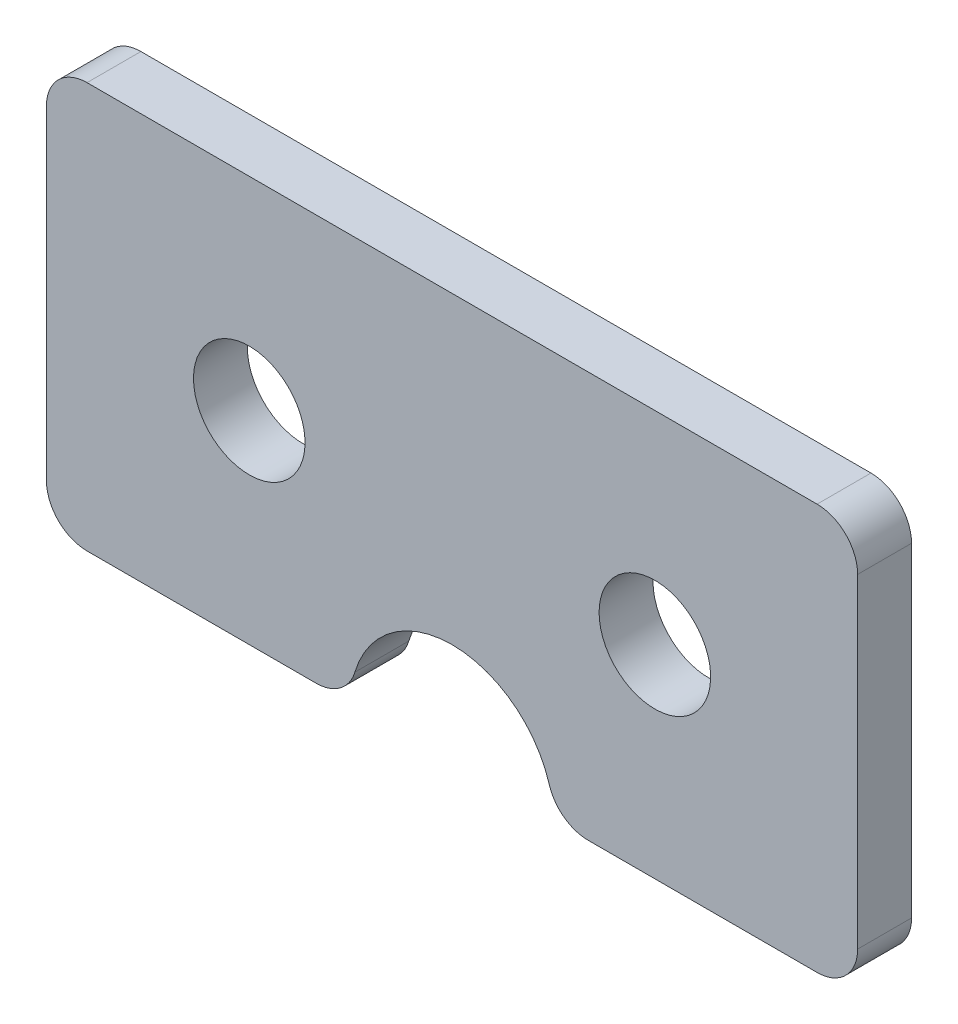
ISO-10303-21;
HEADER;
FILE_DESCRIPTION(('STEP AP214'),'2;1');
FILE_NAME('part.step','',(''),(''),'','','');
FILE_SCHEMA(('AUTOMOTIVE_DESIGN { 1 0 10303 214 1 1 1 1 }'));
ENDSEC;
DATA;
#1=APPLICATION_CONTEXT('core data for automotive mechanical design processes');
#2=APPLICATION_PROTOCOL_DEFINITION('international standard','automotive_design',2000,#1);
#3=PRODUCT_CONTEXT('',#1,'mechanical');
#4=PRODUCT('Part','Part','',(#3));
#5=PRODUCT_RELATED_PRODUCT_CATEGORY('part','',(#4));
#6=PRODUCT_DEFINITION_FORMATION('','',#4);
#7=PRODUCT_DEFINITION_CONTEXT('part definition',#1,'design');
#8=PRODUCT_DEFINITION('design','',#6,#7);
#9=PRODUCT_DEFINITION_SHAPE('','',#8);
#10=(LENGTH_UNIT() NAMED_UNIT(*) SI_UNIT(.MILLI.,.METRE.));
#11=(NAMED_UNIT(*) PLANE_ANGLE_UNIT() SI_UNIT($,.RADIAN.));
#12=(NAMED_UNIT(*) SI_UNIT($,.STERADIAN.) SOLID_ANGLE_UNIT());
#13=UNCERTAINTY_MEASURE_WITH_UNIT(LENGTH_MEASURE(1.E-05),#10,'distance_accuracy_value','');
#14=(GEOMETRIC_REPRESENTATION_CONTEXT(3) GLOBAL_UNCERTAINTY_ASSIGNED_CONTEXT((#13)) GLOBAL_UNIT_ASSIGNED_CONTEXT((#10,
#11,#12)) REPRESENTATION_CONTEXT('',''));
#15=CARTESIAN_POINT('',(0.,0.,0.));
#16=DIRECTION('',(0.,0.,1.));
#17=DIRECTION('',(1.,0.,0.));
#18=AXIS2_PLACEMENT_3D('',#15,#16,#17);
#19=CARTESIAN_POINT('',(0.,0.161688531272491,0.));
#20=DIRECTION('',(0.,0.,1.));
#21=DIRECTION('',(1.,0.,0.));
#22=AXIS2_PLACEMENT_3D('',#19,#20,#21);
#23=PLANE('',#22);
#24=DIRECTION('',(-1.,0.,0.));
#25=VECTOR('',#24,1.);
#26=CARTESIAN_POINT('',(20.,10.,0.));
#27=LINE('',#26,#25);
#28=CARTESIAN_POINT('',(18.,10.,0.));
#29=VERTEX_POINT('',#28);
#30=CARTESIAN_POINT('',(-18.,10.,0.));
#31=VERTEX_POINT('',#30);
#32=EDGE_CURVE('E107',#29,#31,#27,.T.);
#33=ORIENTED_EDGE('',*,*,#32,.F.);
#34=CARTESIAN_POINT('',(18.,8.,0.));
#35=DIRECTION('',(0.,0.,1.));
#36=DIRECTION('',(1.,0.,0.));
#37=AXIS2_PLACEMENT_3D('',#34,#35,#36);
#38=CIRCLE('',#37,2.);
#39=CARTESIAN_POINT('',(20.,8.,0.));
#40=VERTEX_POINT('',#39);
#41=EDGE_CURVE('E120',#40,#29,#38,.T.);
#42=ORIENTED_EDGE('',*,*,#41,.F.);
#43=DIRECTION('',(0.,1.,0.));
#44=VECTOR('',#43,1.);
#45=CARTESIAN_POINT('',(20.,-10.,0.));
#46=LINE('',#45,#44);
#47=CARTESIAN_POINT('',(20.,-8.,0.));
#48=VERTEX_POINT('',#47);
#49=EDGE_CURVE('E132',#48,#40,#46,.T.);
#50=ORIENTED_EDGE('',*,*,#49,.F.);
#51=CARTESIAN_POINT('',(18.,-8.,0.));
#52=DIRECTION('',(0.,0.,1.));
#53=DIRECTION('',(1.,0.,0.));
#54=AXIS2_PLACEMENT_3D('',#51,#52,#53);
#55=CIRCLE('',#54,2.);
#56=CARTESIAN_POINT('',(18.,-10.,0.));
#57=VERTEX_POINT('',#56);
#58=EDGE_CURVE('E175',#57,#48,#55,.T.);
#59=ORIENTED_EDGE('',*,*,#58,.F.);
#60=DIRECTION('',(1.,0.,0.));
#61=VECTOR('',#60,1.);
#62=CARTESIAN_POINT('',(5.,-10.,0.));
#63=LINE('',#62,#61);
#64=CARTESIAN_POINT('',(6.70820393249937,-10.,0.));
#65=VERTEX_POINT('',#64);
#66=EDGE_CURVE('E136',#65,#57,#63,.T.);
#67=ORIENTED_EDGE('',*,*,#66,.F.);
#68=CARTESIAN_POINT('',(6.70820393249937,-8.,0.));
#69=DIRECTION('',(0.,0.,1.));
#70=DIRECTION('',(1.,0.,0.));
#71=AXIS2_PLACEMENT_3D('',#68,#69,#70);
#72=CIRCLE('',#71,2.);
#73=CARTESIAN_POINT('',(4.79157423749955,-8.57142857142857,0.));
#74=VERTEX_POINT('',#73);
#75=EDGE_CURVE('E177',#74,#65,#72,.T.);
#76=ORIENTED_EDGE('',*,*,#75,.F.);
#77=CARTESIAN_POINT('',(0.,-10.,0.));
#78=DIRECTION('',(0.,0.,1.));
#79=DIRECTION('',(1.,0.,0.));
#80=AXIS2_PLACEMENT_3D('',#77,#78,#79);
#81=CIRCLE('',#80,5.);
#82=CARTESIAN_POINT('',(-4.79157423749955,-8.57142857142857,0.));
#83=VERTEX_POINT('',#82);
#84=EDGE_CURVE('E180',#74,#83,#81,.T.);
#85=ORIENTED_EDGE('',*,*,#84,.T.);
#86=CARTESIAN_POINT('',(-6.70820393249937,-8.,0.));
#87=DIRECTION('',(0.,0.,1.));
#88=DIRECTION('',(1.,0.,0.));
#89=AXIS2_PLACEMENT_3D('',#86,#87,#88);
#90=CIRCLE('',#89,2.);
#91=CARTESIAN_POINT('',(-6.70820393249937,-9.99999999999999,0.));
#92=VERTEX_POINT('',#91);
#93=EDGE_CURVE('E183',#92,#83,#90,.T.);
#94=ORIENTED_EDGE('',*,*,#93,.F.);
#95=DIRECTION('',(1.,0.,0.));
#96=VECTOR('',#95,1.);
#97=CARTESIAN_POINT('',(-20.,-9.99999999999999,0.));
#98=LINE('',#97,#96);
#99=CARTESIAN_POINT('',(-18.,-9.99999999999999,0.));
#100=VERTEX_POINT('',#99);
#101=EDGE_CURVE('E140',#100,#92,#98,.T.);
#102=ORIENTED_EDGE('',*,*,#101,.F.);
#103=CARTESIAN_POINT('',(-18.,-7.99999999999999,0.));
#104=DIRECTION('',(0.,0.,1.));
#105=DIRECTION('',(1.,0.,0.));
#106=AXIS2_PLACEMENT_3D('',#103,#104,#105);
#107=CIRCLE('',#106,2.);
#108=CARTESIAN_POINT('',(-20.,-7.99999999999999,0.));
#109=VERTEX_POINT('',#108);
#110=EDGE_CURVE('E185',#109,#100,#107,.T.);
#111=ORIENTED_EDGE('',*,*,#110,.F.);
#112=DIRECTION('',(0.,-1.,0.));
#113=VECTOR('',#112,1.);
#114=CARTESIAN_POINT('',(-20.,10.,0.));
#115=LINE('',#114,#113);
#116=CARTESIAN_POINT('',(-20.,8.,0.));
#117=VERTEX_POINT('',#116);
#118=EDGE_CURVE('E109',#117,#109,#115,.T.);
#119=ORIENTED_EDGE('',*,*,#118,.F.);
#120=CARTESIAN_POINT('',(-18.,8.,0.));
#121=DIRECTION('',(0.,0.,1.));
#122=DIRECTION('',(1.,0.,0.));
#123=AXIS2_PLACEMENT_3D('',#120,#121,#122);
#124=CIRCLE('',#123,2.);
#125=EDGE_CURVE('E19',#31,#117,#124,.T.);
#126=ORIENTED_EDGE('',*,*,#125,.F.);
#127=EDGE_LOOP('',(#33,#42,#50,#59,#67,#76,#85,#94,#102,#111,#119,#126));
#128=FACE_BOUND('',#127,.T.);
#129=CARTESIAN_POINT('',(10.,0.,0.));
#130=DIRECTION('',(0.,0.,-1.));
#131=DIRECTION('',(-1.,0.,0.));
#132=AXIS2_PLACEMENT_3D('',#129,#130,#131);
#133=CIRCLE('',#132,2.75);
#134=CARTESIAN_POINT('',(7.25,0.,0.));
#135=VERTEX_POINT('',#134);
#136=EDGE_CURVE('E126',#135,#135,#133,.F.);
#137=ORIENTED_EDGE('',*,*,#136,.T.);
#138=EDGE_LOOP('',(#137));
#139=FACE_BOUND('',#138,.T.);
#140=CARTESIAN_POINT('',(-10.,0.,0.));
#141=DIRECTION('',(0.,0.,-1.));
#142=DIRECTION('',(-1.,0.,0.));
#143=AXIS2_PLACEMENT_3D('',#140,#141,#142);
#144=CIRCLE('',#143,2.75);
#145=CARTESIAN_POINT('',(-12.75,0.,0.));
#146=VERTEX_POINT('',#145);
#147=EDGE_CURVE('E123',#146,#146,#144,.F.);
#148=ORIENTED_EDGE('',*,*,#147,.T.);
#149=EDGE_LOOP('',(#148));
#150=FACE_BOUND('',#149,.T.);
#151=ADVANCED_FACE('F16',(#128,#139,#150),#23,.F.);
#152=CARTESIAN_POINT('',(-18.,8.,0.));
#153=DIRECTION('',(0.,0.,1.));
#154=DIRECTION('',(1.,0.,0.));
#155=AXIS2_PLACEMENT_3D('',#152,#153,#154);
#156=CYLINDRICAL_SURFACE('',#155,2.);
#157=ORIENTED_EDGE('',*,*,#125,.T.);
#158=DIRECTION('',(0.,0.,1.));
#159=VECTOR('',#158,1.);
#160=CARTESIAN_POINT('',(-20.,8.,0.));
#161=LINE('',#160,#159);
#162=CARTESIAN_POINT('',(-20.,8.,2.65684));
#163=VERTEX_POINT('',#162);
#164=EDGE_CURVE('E112',#163,#117,#161,.F.);
#165=ORIENTED_EDGE('',*,*,#164,.F.);
#166=CARTESIAN_POINT('',(-18.,8.,2.65684));
#167=DIRECTION('',(0.,0.,1.));
#168=DIRECTION('',(1.,0.,0.));
#169=AXIS2_PLACEMENT_3D('',#166,#167,#168);
#170=CIRCLE('',#169,2.);
#171=CARTESIAN_POINT('',(-18.,10.,2.65684));
#172=VERTEX_POINT('',#171);
#173=EDGE_CURVE('E117',#172,#163,#170,.T.);
#174=ORIENTED_EDGE('',*,*,#173,.F.);
#175=DIRECTION('',(0.,0.,1.));
#176=VECTOR('',#175,1.);
#177=CARTESIAN_POINT('',(-18.,10.,0.));
#178=LINE('',#177,#176);
#179=EDGE_CURVE('E114',#31,#172,#178,.T.);
#180=ORIENTED_EDGE('',*,*,#179,.F.);
#181=EDGE_LOOP('',(#157,#165,#174,#180));
#182=FACE_BOUND('',#181,.T.);
#183=ADVANCED_FACE('F115',(#182),#156,.T.);
#184=CARTESIAN_POINT('',(-20.,10.,0.));
#185=DIRECTION('',(-1.,0.,0.));
#186=DIRECTION('',(0.,-1.,0.));
#187=AXIS2_PLACEMENT_3D('',#184,#185,#186);
#188=PLANE('',#187);
#189=DIRECTION('',(0.,0.,1.));
#190=VECTOR('',#189,1.);
#191=CARTESIAN_POINT('',(-20.,-7.99999999999999,0.));
#192=LINE('',#191,#190);
#193=CARTESIAN_POINT('',(-20.,-7.99999999999999,2.65684));
#194=VERTEX_POINT('',#193);
#195=EDGE_CURVE('E144',#194,#109,#192,.F.);
#196=ORIENTED_EDGE('',*,*,#195,.F.);
#197=DIRECTION('',(0.,1.,0.));
#198=VECTOR('',#197,1.);
#199=CARTESIAN_POINT('',(-20.,0.161688531272491,2.65684));
#200=LINE('',#199,#198);
#201=EDGE_CURVE('E170',#163,#194,#200,.F.);
#202=ORIENTED_EDGE('',*,*,#201,.F.);
#203=ORIENTED_EDGE('',*,*,#164,.T.);
#204=ORIENTED_EDGE('',*,*,#118,.T.);
#205=EDGE_LOOP('',(#196,#202,#203,#204));
#206=FACE_BOUND('',#205,.T.);
#207=ADVANCED_FACE('F247',(#206),#188,.T.);
#208=CARTESIAN_POINT('',(-18.,-7.99999999999999,0.));
#209=DIRECTION('',(0.,0.,1.));
#210=DIRECTION('',(1.,0.,0.));
#211=AXIS2_PLACEMENT_3D('',#208,#209,#210);
#212=CYLINDRICAL_SURFACE('',#211,2.);
#213=ORIENTED_EDGE('',*,*,#110,.T.);
#214=DIRECTION('',(0.,0.,1.));
#215=VECTOR('',#214,1.);
#216=CARTESIAN_POINT('',(-18.,-9.99999999999999,0.));
#217=LINE('',#216,#215);
#218=CARTESIAN_POINT('',(-18.,-9.99999999999999,2.65684));
#219=VERTEX_POINT('',#218);
#220=EDGE_CURVE('E143',#219,#100,#217,.F.);
#221=ORIENTED_EDGE('',*,*,#220,.F.);
#222=CARTESIAN_POINT('',(-18.,-7.99999999999999,2.65684));
#223=DIRECTION('',(0.,0.,1.));
#224=DIRECTION('',(1.,0.,0.));
#225=AXIS2_PLACEMENT_3D('',#222,#223,#224);
#226=CIRCLE('',#225,2.);
#227=EDGE_CURVE('E167',#194,#219,#226,.T.);
#228=ORIENTED_EDGE('',*,*,#227,.F.);
#229=ORIENTED_EDGE('',*,*,#195,.T.);
#230=EDGE_LOOP('',(#213,#221,#228,#229));
#231=FACE_BOUND('',#230,.T.);
#232=ADVANCED_FACE('F244',(#231),#212,.T.);
#233=CARTESIAN_POINT('',(-20.,-9.99999999999999,0.));
#234=DIRECTION('',(0.,-1.,0.));
#235=DIRECTION('',(1.,0.,0.));
#236=AXIS2_PLACEMENT_3D('',#233,#234,#235);
#237=PLANE('',#236);
#238=ORIENTED_EDGE('',*,*,#220,.T.);
#239=ORIENTED_EDGE('',*,*,#101,.T.);
#240=DIRECTION('',(0.,0.,1.));
#241=VECTOR('',#240,1.);
#242=CARTESIAN_POINT('',(-6.70820393249937,-10.,0.));
#243=LINE('',#242,#241);
#244=CARTESIAN_POINT('',(-6.70820393249937,-9.99999999999999,2.65684));
#245=VERTEX_POINT('',#244);
#246=EDGE_CURVE('E142',#245,#92,#243,.F.);
#247=ORIENTED_EDGE('',*,*,#246,.F.);
#248=DIRECTION('',(1.,0.,0.));
#249=VECTOR('',#248,1.);
#250=CARTESIAN_POINT('',(0.,-9.99999999999999,2.65684));
#251=LINE('',#250,#249);
#252=EDGE_CURVE('E166',#219,#245,#251,.T.);
#253=ORIENTED_EDGE('',*,*,#252,.F.);
#254=EDGE_LOOP('',(#238,#239,#247,#253));
#255=FACE_BOUND('',#254,.T.);
#256=ADVANCED_FACE('F243',(#255),#237,.T.);
#257=CARTESIAN_POINT('',(-6.70820393249937,-8.,0.));
#258=DIRECTION('',(0.,0.,1.));
#259=DIRECTION('',(1.,0.,0.));
#260=AXIS2_PLACEMENT_3D('',#257,#258,#259);
#261=CYLINDRICAL_SURFACE('',#260,2.);
#262=ORIENTED_EDGE('',*,*,#93,.T.);
#263=DIRECTION('',(0.,0.,1.));
#264=VECTOR('',#263,1.);
#265=CARTESIAN_POINT('',(-4.79157423749955,-8.57142857142857,0.));
#266=LINE('',#265,#264);
#267=CARTESIAN_POINT('',(-4.79157423749955,-8.57142857142857,2.65684));
#268=VERTEX_POINT('',#267);
#269=EDGE_CURVE('E182',#83,#268,#266,.T.);
#270=ORIENTED_EDGE('',*,*,#269,.T.);
#271=CARTESIAN_POINT('',(-6.70820393249937,-8.,2.65684));
#272=DIRECTION('',(0.,0.,1.));
#273=DIRECTION('',(1.,0.,0.));
#274=AXIS2_PLACEMENT_3D('',#271,#272,#273);
#275=CIRCLE('',#274,2.);
#276=EDGE_CURVE('E163',#245,#268,#275,.T.);
#277=ORIENTED_EDGE('',*,*,#276,.F.);
#278=ORIENTED_EDGE('',*,*,#246,.T.);
#279=EDGE_LOOP('',(#262,#270,#277,#278));
#280=FACE_BOUND('',#279,.T.);
#281=ADVANCED_FACE('F237',(#280),#261,.T.);
#282=CARTESIAN_POINT('',(0.,-10.,0.));
#283=DIRECTION('',(0.,0.,1.));
#284=DIRECTION('',(1.,0.,0.));
#285=AXIS2_PLACEMENT_3D('',#282,#283,#284);
#286=CYLINDRICAL_SURFACE('',#285,5.);
#287=CARTESIAN_POINT('',(0.,-10.,2.65684));
#288=DIRECTION('',(0.,0.,1.));
#289=DIRECTION('',(1.,0.,0.));
#290=AXIS2_PLACEMENT_3D('',#287,#288,#289);
#291=CIRCLE('',#290,5.);
#292=CARTESIAN_POINT('',(4.79157423749955,-8.57142857142857,2.65684));
#293=VERTEX_POINT('',#292);
#294=EDGE_CURVE('E160',#268,#293,#291,.F.);
#295=ORIENTED_EDGE('',*,*,#294,.F.);
#296=ORIENTED_EDGE('',*,*,#269,.F.);
#297=ORIENTED_EDGE('',*,*,#84,.F.);
#298=DIRECTION('',(0.,0.,1.));
#299=VECTOR('',#298,1.);
#300=CARTESIAN_POINT('',(4.79157423749955,-8.57142857142857,0.));
#301=LINE('',#300,#299);
#302=EDGE_CURVE('E179',#293,#74,#301,.F.);
#303=ORIENTED_EDGE('',*,*,#302,.F.);
#304=EDGE_LOOP('',(#295,#296,#297,#303));
#305=FACE_BOUND('',#304,.T.);
#306=ADVANCED_FACE('F240',(#305),#286,.F.);
#307=CARTESIAN_POINT('',(6.70820393249937,-8.,0.));
#308=DIRECTION('',(0.,0.,1.));
#309=DIRECTION('',(1.,0.,0.));
#310=AXIS2_PLACEMENT_3D('',#307,#308,#309);
#311=CYLINDRICAL_SURFACE('',#310,2.);
#312=ORIENTED_EDGE('',*,*,#75,.T.);
#313=DIRECTION('',(0.,0.,1.));
#314=VECTOR('',#313,1.);
#315=CARTESIAN_POINT('',(6.70820393249937,-10.,0.));
#316=LINE('',#315,#314);
#317=CARTESIAN_POINT('',(6.70820393249937,-10.,2.65684));
#318=VERTEX_POINT('',#317);
#319=EDGE_CURVE('E139',#318,#65,#316,.F.);
#320=ORIENTED_EDGE('',*,*,#319,.F.);
#321=CARTESIAN_POINT('',(6.70820393249937,-8.,2.65684));
#322=DIRECTION('',(0.,0.,1.));
#323=DIRECTION('',(1.,0.,0.));
#324=AXIS2_PLACEMENT_3D('',#321,#322,#323);
#325=CIRCLE('',#324,2.);
#326=EDGE_CURVE('E157',#293,#318,#325,.T.);
#327=ORIENTED_EDGE('',*,*,#326,.F.);
#328=ORIENTED_EDGE('',*,*,#302,.T.);
#329=EDGE_LOOP('',(#312,#320,#327,#328));
#330=FACE_BOUND('',#329,.T.);
#331=ADVANCED_FACE('F232',(#330),#311,.T.);
#332=CARTESIAN_POINT('',(5.,-10.,0.));
#333=DIRECTION('',(0.,-1.,0.));
#334=DIRECTION('',(1.,0.,0.));
#335=AXIS2_PLACEMENT_3D('',#332,#333,#334);
#336=PLANE('',#335);
#337=DIRECTION('',(0.,0.,1.));
#338=VECTOR('',#337,1.);
#339=CARTESIAN_POINT('',(18.,-10.,0.));
#340=LINE('',#339,#338);
#341=CARTESIAN_POINT('',(18.,-10.,2.65684));
#342=VERTEX_POINT('',#341);
#343=EDGE_CURVE('E138',#342,#57,#340,.F.);
#344=ORIENTED_EDGE('',*,*,#343,.F.);
#345=DIRECTION('',(1.,0.,0.));
#346=VECTOR('',#345,1.);
#347=CARTESIAN_POINT('',(0.,-10.,2.65684));
#348=LINE('',#347,#346);
#349=EDGE_CURVE('E156',#318,#342,#348,.T.);
#350=ORIENTED_EDGE('',*,*,#349,.F.);
#351=ORIENTED_EDGE('',*,*,#319,.T.);
#352=ORIENTED_EDGE('',*,*,#66,.T.);
#353=EDGE_LOOP('',(#344,#350,#351,#352));
#354=FACE_BOUND('',#353,.T.);
#355=ADVANCED_FACE('F229',(#354),#336,.T.);
#356=CARTESIAN_POINT('',(18.,-8.,0.));
#357=DIRECTION('',(0.,0.,1.));
#358=DIRECTION('',(1.,0.,0.));
#359=AXIS2_PLACEMENT_3D('',#356,#357,#358);
#360=CYLINDRICAL_SURFACE('',#359,2.);
#361=ORIENTED_EDGE('',*,*,#58,.T.);
#362=DIRECTION('',(0.,0.,-1.));
#363=VECTOR('',#362,1.);
#364=CARTESIAN_POINT('',(20.,-8.,0.));
#365=LINE('',#364,#363);
#366=CARTESIAN_POINT('',(20.,-8.,2.65684));
#367=VERTEX_POINT('',#366);
#368=EDGE_CURVE('E135',#367,#48,#365,.T.);
#369=ORIENTED_EDGE('',*,*,#368,.F.);
#370=CARTESIAN_POINT('',(18.,-8.,2.65684));
#371=DIRECTION('',(0.,0.,1.));
#372=DIRECTION('',(1.,0.,0.));
#373=AXIS2_PLACEMENT_3D('',#370,#371,#372);
#374=CIRCLE('',#373,2.);
#375=EDGE_CURVE('E153',#342,#367,#374,.T.);
#376=ORIENTED_EDGE('',*,*,#375,.F.);
#377=ORIENTED_EDGE('',*,*,#343,.T.);
#378=EDGE_LOOP('',(#361,#369,#376,#377));
#379=FACE_BOUND('',#378,.T.);
#380=ADVANCED_FACE('F226',(#379),#360,.T.);
#381=CARTESIAN_POINT('',(20.,-10.,0.));
#382=DIRECTION('',(1.,0.,0.));
#383=DIRECTION('',(0.,0.,-1.));
#384=AXIS2_PLACEMENT_3D('',#381,#382,#383);
#385=PLANE('',#384);
#386=ORIENTED_EDGE('',*,*,#368,.T.);
#387=ORIENTED_EDGE('',*,*,#49,.T.);
#388=DIRECTION('',(0.,0.,1.));
#389=VECTOR('',#388,1.);
#390=CARTESIAN_POINT('',(20.,8.,0.));
#391=LINE('',#390,#389);
#392=CARTESIAN_POINT('',(20.,8.,2.65684));
#393=VERTEX_POINT('',#392);
#394=EDGE_CURVE('E134',#393,#40,#391,.F.);
#395=ORIENTED_EDGE('',*,*,#394,.F.);
#396=DIRECTION('',(0.,1.,0.));
#397=VECTOR('',#396,1.);
#398=CARTESIAN_POINT('',(20.,0.161688531272491,2.65684));
#399=LINE('',#398,#397);
#400=EDGE_CURVE('E152',#367,#393,#399,.T.);
#401=ORIENTED_EDGE('',*,*,#400,.F.);
#402=EDGE_LOOP('',(#386,#387,#395,#401));
#403=FACE_BOUND('',#402,.T.);
#404=ADVANCED_FACE('F219',(#403),#385,.T.);
#405=CARTESIAN_POINT('',(18.,8.,0.));
#406=DIRECTION('',(0.,0.,1.));
#407=DIRECTION('',(1.,0.,0.));
#408=AXIS2_PLACEMENT_3D('',#405,#406,#407);
#409=CYLINDRICAL_SURFACE('',#408,2.);
#410=ORIENTED_EDGE('',*,*,#41,.T.);
#411=DIRECTION('',(0.,0.,1.));
#412=VECTOR('',#411,1.);
#413=CARTESIAN_POINT('',(18.,10.,0.));
#414=LINE('',#413,#412);
#415=CARTESIAN_POINT('',(18.,10.,2.65684));
#416=VERTEX_POINT('',#415);
#417=EDGE_CURVE('E34',#416,#29,#414,.F.);
#418=ORIENTED_EDGE('',*,*,#417,.F.);
#419=CARTESIAN_POINT('',(18.,8.,2.65684));
#420=DIRECTION('',(0.,0.,1.));
#421=DIRECTION('',(1.,0.,0.));
#422=AXIS2_PLACEMENT_3D('',#419,#420,#421);
#423=CIRCLE('',#422,2.);
#424=EDGE_CURVE('E149',#393,#416,#423,.T.);
#425=ORIENTED_EDGE('',*,*,#424,.F.);
#426=ORIENTED_EDGE('',*,*,#394,.T.);
#427=EDGE_LOOP('',(#410,#418,#425,#426));
#428=FACE_BOUND('',#427,.T.);
#429=ADVANCED_FACE('F217',(#428),#409,.T.);
#430=CARTESIAN_POINT('',(20.,10.,0.));
#431=DIRECTION('',(0.,1.,0.));
#432=DIRECTION('',(-1.,0.,0.));
#433=AXIS2_PLACEMENT_3D('',#430,#431,#432);
#434=PLANE('',#433);
#435=ORIENTED_EDGE('',*,*,#417,.T.);
#436=ORIENTED_EDGE('',*,*,#32,.T.);
#437=ORIENTED_EDGE('',*,*,#179,.T.);
#438=DIRECTION('',(1.,0.,0.));
#439=VECTOR('',#438,1.);
#440=CARTESIAN_POINT('',(0.,10.,2.65684));
#441=LINE('',#440,#439);
#442=EDGE_CURVE('E148',#416,#172,#441,.F.);
#443=ORIENTED_EDGE('',*,*,#442,.F.);
#444=EDGE_LOOP('',(#435,#436,#437,#443));
#445=FACE_BOUND('',#444,.T.);
#446=ADVANCED_FACE('F122',(#445),#434,.T.);
#447=CARTESIAN_POINT('',(-10.,0.,2.65684));
#448=DIRECTION('',(0.,0.,-1.));
#449=DIRECTION('',(-1.,0.,0.));
#450=AXIS2_PLACEMENT_3D('',#447,#448,#449);
#451=CYLINDRICAL_SURFACE('',#450,2.75);
#452=CARTESIAN_POINT('',(-10.,0.,2.65684));
#453=DIRECTION('',(0.,0.,-1.));
#454=DIRECTION('',(-1.,0.,0.));
#455=AXIS2_PLACEMENT_3D('',#452,#453,#454);
#456=CIRCLE('',#455,2.75);
#457=CARTESIAN_POINT('',(-12.75,0.,2.65684));
#458=VERTEX_POINT('',#457);
#459=EDGE_CURVE('E25',#458,#458,#456,.T.);
#460=ORIENTED_EDGE('',*,*,#459,.F.);
#461=EDGE_LOOP('',(#460));
#462=FACE_BOUND('',#461,.T.);
#463=ORIENTED_EDGE('',*,*,#147,.F.);
#464=EDGE_LOOP('',(#463));
#465=FACE_BOUND('',#464,.T.);
#466=ADVANCED_FACE('F263',(#462,#465),#451,.F.);
#467=CARTESIAN_POINT('',(10.,0.,2.65684));
#468=DIRECTION('',(0.,0.,-1.));
#469=DIRECTION('',(-1.,0.,0.));
#470=AXIS2_PLACEMENT_3D('',#467,#468,#469);
#471=CYLINDRICAL_SURFACE('',#470,2.75);
#472=CARTESIAN_POINT('',(10.,0.,2.65684));
#473=DIRECTION('',(0.,0.,-1.));
#474=DIRECTION('',(-1.,0.,0.));
#475=AXIS2_PLACEMENT_3D('',#472,#473,#474);
#476=CIRCLE('',#475,2.75);
#477=CARTESIAN_POINT('',(7.25,0.,2.65684));
#478=VERTEX_POINT('',#477);
#479=EDGE_CURVE('E11',#478,#478,#476,.T.);
#480=ORIENTED_EDGE('',*,*,#479,.F.);
#481=EDGE_LOOP('',(#480));
#482=FACE_BOUND('',#481,.T.);
#483=ORIENTED_EDGE('',*,*,#136,.F.);
#484=EDGE_LOOP('',(#483));
#485=FACE_BOUND('',#484,.T.);
#486=ADVANCED_FACE('F257',(#482,#485),#471,.F.);
#487=CARTESIAN_POINT('',(0.,0.161688531272491,2.65684));
#488=DIRECTION('',(0.,0.,1.));
#489=DIRECTION('',(1.,0.,0.));
#490=AXIS2_PLACEMENT_3D('',#487,#488,#489);
#491=PLANE('',#490);
#492=ORIENTED_EDGE('',*,*,#479,.T.);
#493=EDGE_LOOP('',(#492));
#494=FACE_BOUND('',#493,.T.);
#495=ORIENTED_EDGE('',*,*,#459,.T.);
#496=EDGE_LOOP('',(#495));
#497=FACE_BOUND('',#496,.T.);
#498=ORIENTED_EDGE('',*,*,#424,.T.);
#499=ORIENTED_EDGE('',*,*,#442,.T.);
#500=ORIENTED_EDGE('',*,*,#173,.T.);
#501=ORIENTED_EDGE('',*,*,#201,.T.);
#502=ORIENTED_EDGE('',*,*,#227,.T.);
#503=ORIENTED_EDGE('',*,*,#252,.T.);
#504=ORIENTED_EDGE('',*,*,#276,.T.);
#505=ORIENTED_EDGE('',*,*,#294,.T.);
#506=ORIENTED_EDGE('',*,*,#326,.T.);
#507=ORIENTED_EDGE('',*,*,#349,.T.);
#508=ORIENTED_EDGE('',*,*,#375,.T.);
#509=ORIENTED_EDGE('',*,*,#400,.T.);
#510=EDGE_LOOP('',(#498,#499,#500,#501,#502,#503,#504,#505,#506,#507,#508,#509));
#511=FACE_BOUND('',#510,.T.);
#512=ADVANCED_FACE('F215',(#494,#497,#511),#491,.T.);
#513=CLOSED_SHELL('',(#151,#183,#207,#232,#256,#281,#306,#331,#355,#380,#404,#429,#446,#466,
#486,#512));
#514=MANIFOLD_SOLID_BREP('B1',#513);
#515=ADVANCED_BREP_SHAPE_REPRESENTATION('',(#18,#514),#14);
#516=SHAPE_DEFINITION_REPRESENTATION(#9,#515);
ENDSEC;
END-ISO-10303-21;
